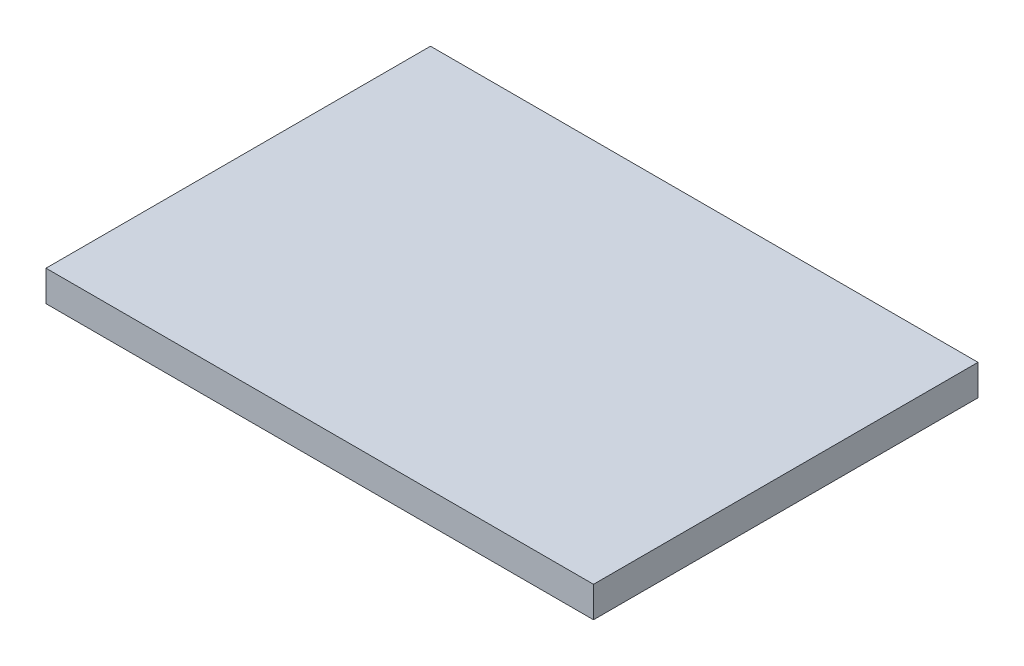
ISO-10303-21;
HEADER;
FILE_DESCRIPTION(('STEP AP214'),'2;1');
FILE_NAME('part.step','',(''),(''),'','','');
FILE_SCHEMA(('AUTOMOTIVE_DESIGN { 1 0 10303 214 1 1 1 1 }'));
ENDSEC;
DATA;
#1=APPLICATION_CONTEXT('core data for automotive mechanical design processes');
#2=APPLICATION_PROTOCOL_DEFINITION('international standard','automotive_design',2000,#1);
#3=PRODUCT_CONTEXT('',#1,'mechanical');
#4=PRODUCT('Part','Part','',(#3));
#5=PRODUCT_RELATED_PRODUCT_CATEGORY('part','',(#4));
#6=PRODUCT_DEFINITION_FORMATION('','',#4);
#7=PRODUCT_DEFINITION_CONTEXT('part definition',#1,'design');
#8=PRODUCT_DEFINITION('design','',#6,#7);
#9=PRODUCT_DEFINITION_SHAPE('','',#8);
#10=(LENGTH_UNIT() NAMED_UNIT(*) SI_UNIT(.MILLI.,.METRE.));
#11=(NAMED_UNIT(*) PLANE_ANGLE_UNIT() SI_UNIT($,.RADIAN.));
#12=(NAMED_UNIT(*) SI_UNIT($,.STERADIAN.) SOLID_ANGLE_UNIT());
#13=UNCERTAINTY_MEASURE_WITH_UNIT(LENGTH_MEASURE(1.E-05),#10,'distance_accuracy_value','');
#14=(GEOMETRIC_REPRESENTATION_CONTEXT(3) GLOBAL_UNCERTAINTY_ASSIGNED_CONTEXT((#13)) GLOBAL_UNIT_ASSIGNED_CONTEXT((#10,
#11,#12)) REPRESENTATION_CONTEXT('',''));
#15=CARTESIAN_POINT('',(0.,0.,0.));
#16=DIRECTION('',(0.,0.,1.));
#17=DIRECTION('',(1.,0.,0.));
#18=AXIS2_PLACEMENT_3D('',#15,#16,#17);
#19=CARTESIAN_POINT('',(-28.3144186046512,2.,-6.86883720930233));
#20=DIRECTION('',(1.,0.,0.));
#21=DIRECTION('',(0.,0.,-1.));
#22=AXIS2_PLACEMENT_3D('',#19,#20,#21);
#23=PLANE('',#22);
#24=DIRECTION('',(0.,0.,1.));
#25=VECTOR('',#24,1.);
#26=CARTESIAN_POINT('',(-28.3144186046512,0.,-6.86883720930233));
#27=LINE('',#26,#25);
#28=CARTESIAN_POINT('',(-28.3144186046512,0.,-6.86883720930233));
#29=VERTEX_POINT('',#28);
#30=CARTESIAN_POINT('',(-28.3144186046512,0.,18.1311627906977));
#31=VERTEX_POINT('',#30);
#32=EDGE_CURVE('E95',#29,#31,#27,.T.);
#33=ORIENTED_EDGE('',*,*,#32,.T.);
#34=DIRECTION('',(0.,-1.,0.));
#35=VECTOR('',#34,1.);
#36=CARTESIAN_POINT('',(-28.3144186046512,2.,18.1311627906977));
#37=LINE('',#36,#35);
#38=CARTESIAN_POINT('',(-28.3144186046512,2.,18.1311627906977));
#39=VERTEX_POINT('',#38);
#40=EDGE_CURVE('E11',#39,#31,#37,.T.);
#41=ORIENTED_EDGE('',*,*,#40,.F.);
#42=DIRECTION('',(0.,0.,1.));
#43=VECTOR('',#42,1.);
#44=CARTESIAN_POINT('',(-28.3144186046512,2.,-6.86883720930233));
#45=LINE('',#44,#43);
#46=CARTESIAN_POINT('',(-28.3144186046512,2.,-6.86883720930233));
#47=VERTEX_POINT('',#46);
#48=EDGE_CURVE('E83',#47,#39,#45,.T.);
#49=ORIENTED_EDGE('',*,*,#48,.F.);
#50=DIRECTION('',(0.,-1.,0.));
#51=VECTOR('',#50,1.);
#52=CARTESIAN_POINT('',(-28.3144186046512,2.,-6.86883720930233));
#53=LINE('',#52,#51);
#54=EDGE_CURVE('E91',#47,#29,#53,.T.);
#55=ORIENTED_EDGE('',*,*,#54,.T.);
#56=EDGE_LOOP('',(#33,#41,#49,#55));
#57=FACE_BOUND('',#56,.T.);
#58=ADVANCED_FACE('F32',(#57),#23,.F.);
#59=CARTESIAN_POINT('',(-28.3144186046512,2.,18.1311627906977));
#60=DIRECTION('',(0.,0.,-1.));
#61=DIRECTION('',(-1.,0.,0.));
#62=AXIS2_PLACEMENT_3D('',#59,#60,#61);
#63=PLANE('',#62);
#64=DIRECTION('',(1.,0.,0.));
#65=VECTOR('',#64,1.);
#66=CARTESIAN_POINT('',(-28.3144186046512,0.,18.1311627906977));
#67=LINE('',#66,#65);
#68=CARTESIAN_POINT('',(7.28558139534884,0.,18.1311627906977));
#69=VERTEX_POINT('',#68);
#70=EDGE_CURVE('E87',#31,#69,#67,.T.);
#71=ORIENTED_EDGE('',*,*,#70,.T.);
#72=DIRECTION('',(0.,-1.,0.));
#73=VECTOR('',#72,1.);
#74=CARTESIAN_POINT('',(7.28558139534884,2.,18.1311627906977));
#75=LINE('',#74,#73);
#76=CARTESIAN_POINT('',(7.28558139534884,2.,18.1311627906977));
#77=VERTEX_POINT('',#76);
#78=EDGE_CURVE('E40',#77,#69,#75,.T.);
#79=ORIENTED_EDGE('',*,*,#78,.F.);
#80=DIRECTION('',(1.,0.,0.));
#81=VECTOR('',#80,1.);
#82=CARTESIAN_POINT('',(-28.3144186046512,2.,18.1311627906977));
#83=LINE('',#82,#81);
#84=EDGE_CURVE('E78',#39,#77,#83,.T.);
#85=ORIENTED_EDGE('',*,*,#84,.F.);
#86=ORIENTED_EDGE('',*,*,#40,.T.);
#87=EDGE_LOOP('',(#71,#79,#85,#86));
#88=FACE_BOUND('',#87,.T.);
#89=ADVANCED_FACE('F86',(#88),#63,.F.);
#90=CARTESIAN_POINT('',(7.28558139534883,2.,-6.86883720930233));
#91=DIRECTION('',(-1.,0.,0.));
#92=DIRECTION('',(0.,0.,1.));
#93=AXIS2_PLACEMENT_3D('',#90,#91,#92);
#94=PLANE('',#93);
#95=DIRECTION('',(0.,0.,-1.));
#96=VECTOR('',#95,1.);
#97=CARTESIAN_POINT('',(7.28558139534883,0.,-6.86883720930233));
#98=LINE('',#97,#96);
#99=CARTESIAN_POINT('',(7.28558139534883,0.,-6.86883720930233));
#100=VERTEX_POINT('',#99);
#101=EDGE_CURVE('E65',#69,#100,#98,.T.);
#102=ORIENTED_EDGE('',*,*,#101,.T.);
#103=DIRECTION('',(0.,-1.,0.));
#104=VECTOR('',#103,1.);
#105=CARTESIAN_POINT('',(7.28558139534883,2.,-6.86883720930233));
#106=LINE('',#105,#104);
#107=CARTESIAN_POINT('',(7.28558139534883,2.,-6.86883720930233));
#108=VERTEX_POINT('',#107);
#109=EDGE_CURVE('E88',#108,#100,#106,.T.);
#110=ORIENTED_EDGE('',*,*,#109,.F.);
#111=DIRECTION('',(0.,0.,-1.));
#112=VECTOR('',#111,1.);
#113=CARTESIAN_POINT('',(7.28558139534883,2.,-6.86883720930233));
#114=LINE('',#113,#112);
#115=EDGE_CURVE('E81',#77,#108,#114,.T.);
#116=ORIENTED_EDGE('',*,*,#115,.F.);
#117=ORIENTED_EDGE('',*,*,#78,.T.);
#118=EDGE_LOOP('',(#102,#110,#116,#117));
#119=FACE_BOUND('',#118,.T.);
#120=ADVANCED_FACE('F89',(#119),#94,.F.);
#121=CARTESIAN_POINT('',(-28.3144186046512,2.,-6.86883720930233));
#122=DIRECTION('',(0.,0.,1.));
#123=DIRECTION('',(1.,0.,0.));
#124=AXIS2_PLACEMENT_3D('',#121,#122,#123);
#125=PLANE('',#124);
#126=DIRECTION('',(-1.,0.,0.));
#127=VECTOR('',#126,1.);
#128=CARTESIAN_POINT('',(-28.3144186046512,0.,-6.86883720930233));
#129=LINE('',#128,#127);
#130=EDGE_CURVE('E71',#100,#29,#129,.T.);
#131=ORIENTED_EDGE('',*,*,#130,.T.);
#132=ORIENTED_EDGE('',*,*,#54,.F.);
#133=DIRECTION('',(-1.,0.,0.));
#134=VECTOR('',#133,1.);
#135=CARTESIAN_POINT('',(-28.3144186046512,2.,-6.86883720930233));
#136=LINE('',#135,#134);
#137=EDGE_CURVE('E48',#108,#47,#136,.T.);
#138=ORIENTED_EDGE('',*,*,#137,.F.);
#139=ORIENTED_EDGE('',*,*,#109,.T.);
#140=EDGE_LOOP('',(#131,#132,#138,#139));
#141=FACE_BOUND('',#140,.T.);
#142=ADVANCED_FACE('F102',(#141),#125,.F.);
#143=CARTESIAN_POINT('',(0.,2.,0.));
#144=DIRECTION('',(0.,1.,0.));
#145=DIRECTION('',(0.,0.,1.));
#146=AXIS2_PLACEMENT_3D('',#143,#144,#145);
#147=PLANE('',#146);
#148=ORIENTED_EDGE('',*,*,#48,.T.);
#149=ORIENTED_EDGE('',*,*,#84,.T.);
#150=ORIENTED_EDGE('',*,*,#115,.T.);
#151=ORIENTED_EDGE('',*,*,#137,.T.);
#152=EDGE_LOOP('',(#148,#149,#150,#151));
#153=FACE_BOUND('',#152,.T.);
#154=ADVANCED_FACE('F79',(#153),#147,.T.);
#155=CARTESIAN_POINT('',(0.,0.,0.));
#156=DIRECTION('',(0.,1.,0.));
#157=DIRECTION('',(0.,0.,1.));
#158=AXIS2_PLACEMENT_3D('',#155,#156,#157);
#159=PLANE('',#158);
#160=ORIENTED_EDGE('',*,*,#32,.F.);
#161=ORIENTED_EDGE('',*,*,#130,.F.);
#162=ORIENTED_EDGE('',*,*,#101,.F.);
#163=ORIENTED_EDGE('',*,*,#70,.F.);
#164=EDGE_LOOP('',(#160,#161,#162,#163));
#165=FACE_BOUND('',#164,.T.);
#166=ADVANCED_FACE('F105',(#165),#159,.F.);
#167=CLOSED_SHELL('',(#58,#89,#120,#142,#154,#166));
#168=MANIFOLD_SOLID_BREP('B2',#167);
#169=ADVANCED_BREP_SHAPE_REPRESENTATION('',(#18,#168),#14);
#170=SHAPE_DEFINITION_REPRESENTATION(#9,#169);
ENDSEC;
END-ISO-10303-21;
